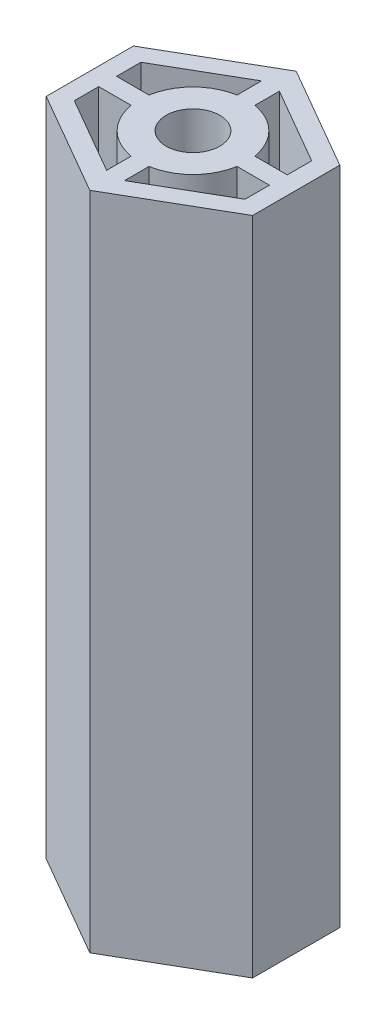
ISO-10303-21;
HEADER;
FILE_DESCRIPTION(('STEP AP214'),'2;1');
FILE_NAME('part.step','',(''),(''),'','','');
FILE_SCHEMA(('AUTOMOTIVE_DESIGN { 1 0 10303 214 1 1 1 1 }'));
ENDSEC;
DATA;
#1=APPLICATION_CONTEXT('core data for automotive mechanical design processes');
#2=APPLICATION_PROTOCOL_DEFINITION('international standard','automotive_design',2000,#1);
#3=PRODUCT_CONTEXT('',#1,'mechanical');
#4=PRODUCT('Part','Part','',(#3));
#5=PRODUCT_RELATED_PRODUCT_CATEGORY('part','',(#4));
#6=PRODUCT_DEFINITION_FORMATION('','',#4);
#7=PRODUCT_DEFINITION_CONTEXT('part definition',#1,'design');
#8=PRODUCT_DEFINITION('design','',#6,#7);
#9=PRODUCT_DEFINITION_SHAPE('','',#8);
#10=(LENGTH_UNIT() NAMED_UNIT(*) SI_UNIT(.MILLI.,.METRE.));
#11=(NAMED_UNIT(*) PLANE_ANGLE_UNIT() SI_UNIT($,.RADIAN.));
#12=(NAMED_UNIT(*) SI_UNIT($,.STERADIAN.) SOLID_ANGLE_UNIT());
#13=UNCERTAINTY_MEASURE_WITH_UNIT(LENGTH_MEASURE(1.E-05),#10,'distance_accuracy_value','');
#14=(GEOMETRIC_REPRESENTATION_CONTEXT(3) GLOBAL_UNCERTAINTY_ASSIGNED_CONTEXT((#13)) GLOBAL_UNIT_ASSIGNED_CONTEXT((#10,
#11,#12)) REPRESENTATION_CONTEXT('',''));
#15=CARTESIAN_POINT('',(0.,0.,0.));
#16=DIRECTION('',(0.,0.,1.));
#17=DIRECTION('',(1.,0.,0.));
#18=AXIS2_PLACEMENT_3D('',#15,#16,#17);
#19=CARTESIAN_POINT('',(0.,80.,0.));
#20=DIRECTION('',(0.,1.,0.));
#21=DIRECTION('',(0.,0.,1.));
#22=AXIS2_PLACEMENT_3D('',#19,#20,#21);
#23=PLANE('',#22);
#24=DIRECTION('',(0.,0.,-1.));
#25=VECTOR('',#24,1.);
#26=CARTESIAN_POINT('',(10.34,80.,1.08));
#27=LINE('',#26,#25);
#28=CARTESIAN_POINT('',(10.34,80.,4.03604505368013));
#29=VERTEX_POINT('',#28);
#30=CARTESIAN_POINT('',(10.34,80.,1.08));
#31=VERTEX_POINT('',#30);
#32=EDGE_CURVE('E222',#29,#31,#27,.T.);
#33=ORIENTED_EDGE('',*,*,#32,.F.);
#34=DIRECTION('',(0.866025403784439,0.,-0.5));
#35=VECTOR('',#34,1.);
#36=CARTESIAN_POINT('',(10.34,80.,4.03604505368013));
#37=LINE('',#36,#35);
#38=CARTESIAN_POINT('',(1.08,80.,9.38230854637606));
#39=VERTEX_POINT('',#38);
#40=EDGE_CURVE('E213',#39,#29,#37,.T.);
#41=ORIENTED_EDGE('',*,*,#40,.F.);
#42=DIRECTION('',(0.,0.,1.));
#43=VECTOR('',#42,1.);
#44=CARTESIAN_POINT('',(1.08,80.,6.40964897634808));
#45=LINE('',#44,#43);
#46=CARTESIAN_POINT('',(1.08,80.,6.40964897634808));
#47=VERTEX_POINT('',#46);
#48=EDGE_CURVE('E247',#47,#39,#45,.T.);
#49=ORIENTED_EDGE('',*,*,#48,.F.);
#50=CARTESIAN_POINT('',(0.,80.,0.));
#51=DIRECTION('',(0.,-1.,0.));
#52=DIRECTION('',(0.,0.,1.));
#53=AXIS2_PLACEMENT_3D('',#50,#51,#52);
#54=CIRCLE('',#53,6.5);
#55=CARTESIAN_POINT('',(6.40964897634808,80.,1.08));
#56=VERTEX_POINT('',#55);
#57=EDGE_CURVE('E241',#56,#47,#54,.T.);
#58=ORIENTED_EDGE('',*,*,#57,.F.);
#59=DIRECTION('',(-1.,0.,0.));
#60=VECTOR('',#59,1.);
#61=CARTESIAN_POINT('',(6.40964897634808,80.,1.08));
#62=LINE('',#61,#60);
#63=EDGE_CURVE('E237',#31,#56,#62,.T.);
#64=ORIENTED_EDGE('',*,*,#63,.F.);
#65=EDGE_LOOP('',(#33,#41,#49,#58,#64));
#66=FACE_BOUND('',#65,.T.);
#67=DIRECTION('',(-1.,0.,0.));
#68=VECTOR('',#67,1.);
#69=CARTESIAN_POINT('',(-10.34,80.,1.08));
#70=LINE('',#69,#68);
#71=CARTESIAN_POINT('',(-6.40964897634808,80.,1.08));
#72=VERTEX_POINT('',#71);
#73=CARTESIAN_POINT('',(-10.34,80.,1.08));
#74=VERTEX_POINT('',#73);
#75=EDGE_CURVE('E278',#72,#74,#70,.T.);
#76=ORIENTED_EDGE('',*,*,#75,.F.);
#77=CARTESIAN_POINT('',(0.,80.,0.));
#78=DIRECTION('',(0.,-1.,0.));
#79=DIRECTION('',(0.,0.,1.));
#80=AXIS2_PLACEMENT_3D('',#77,#78,#79);
#81=CIRCLE('',#80,6.5);
#82=CARTESIAN_POINT('',(-1.08,80.,6.40964897634808));
#83=VERTEX_POINT('',#82);
#84=EDGE_CURVE('E275',#83,#72,#81,.T.);
#85=ORIENTED_EDGE('',*,*,#84,.F.);
#86=DIRECTION('',(0.,0.,-1.));
#87=VECTOR('',#86,1.);
#88=CARTESIAN_POINT('',(-1.08,80.,6.40964897634808));
#89=LINE('',#88,#87);
#90=CARTESIAN_POINT('',(-1.08,80.,9.38230854637607));
#91=VERTEX_POINT('',#90);
#92=EDGE_CURVE('E289',#91,#83,#89,.T.);
#93=ORIENTED_EDGE('',*,*,#92,.F.);
#94=DIRECTION('',(0.866025403784439,0.,0.5));
#95=VECTOR('',#94,1.);
#96=CARTESIAN_POINT('',(-10.34,80.,4.03604505368013));
#97=LINE('',#96,#95);
#98=CARTESIAN_POINT('',(-10.34,80.,4.03604505368013));
#99=VERTEX_POINT('',#98);
#100=EDGE_CURVE('E285',#99,#91,#97,.T.);
#101=ORIENTED_EDGE('',*,*,#100,.F.);
#102=DIRECTION('',(0.,0.,1.));
#103=VECTOR('',#102,1.);
#104=CARTESIAN_POINT('',(-10.34,80.,1.08));
#105=LINE('',#104,#103);
#106=EDGE_CURVE('E282',#74,#99,#105,.T.);
#107=ORIENTED_EDGE('',*,*,#106,.F.);
#108=EDGE_LOOP('',(#76,#85,#93,#101,#107));
#109=FACE_BOUND('',#108,.T.);
#110=DIRECTION('',(0.,0.,-1.));
#111=VECTOR('',#110,1.);
#112=CARTESIAN_POINT('',(-1.08,80.,-9.38230854637594));
#113=LINE('',#112,#111);
#114=CARTESIAN_POINT('',(-1.08,80.,-6.40964897634808));
#115=VERTEX_POINT('',#114);
#116=CARTESIAN_POINT('',(-1.08,80.,-9.38230854637594));
#117=VERTEX_POINT('',#116);
#118=EDGE_CURVE('E331',#115,#117,#113,.T.);
#119=ORIENTED_EDGE('',*,*,#118,.F.);
#120=CARTESIAN_POINT('',(0.,80.,0.));
#121=DIRECTION('',(0.,-1.,0.));
#122=DIRECTION('',(0.,0.,1.));
#123=AXIS2_PLACEMENT_3D('',#120,#121,#122);
#124=CIRCLE('',#123,6.5);
#125=CARTESIAN_POINT('',(-6.40964897634808,80.,-1.08));
#126=VERTEX_POINT('',#125);
#127=EDGE_CURVE('E328',#126,#115,#124,.T.);
#128=ORIENTED_EDGE('',*,*,#127,.F.);
#129=DIRECTION('',(1.,0.,0.));
#130=VECTOR('',#129,1.);
#131=CARTESIAN_POINT('',(-10.34,80.,-1.08));
#132=LINE('',#131,#130);
#133=CARTESIAN_POINT('',(-10.34,80.,-1.08));
#134=VERTEX_POINT('',#133);
#135=EDGE_CURVE('E342',#134,#126,#132,.T.);
#136=ORIENTED_EDGE('',*,*,#135,.F.);
#137=DIRECTION('',(0.,0.,1.));
#138=VECTOR('',#137,1.);
#139=CARTESIAN_POINT('',(-10.34,80.,-4.03604505368));
#140=LINE('',#139,#138);
#141=CARTESIAN_POINT('',(-10.34,80.,-4.03604505368));
#142=VERTEX_POINT('',#141);
#143=EDGE_CURVE('E338',#142,#134,#140,.T.);
#144=ORIENTED_EDGE('',*,*,#143,.F.);
#145=DIRECTION('',(-0.866025403784439,0.,0.5));
#146=VECTOR('',#145,1.);
#147=CARTESIAN_POINT('',(-10.34,80.,-4.03604505368));
#148=LINE('',#147,#146);
#149=EDGE_CURVE('E335',#117,#142,#148,.T.);
#150=ORIENTED_EDGE('',*,*,#149,.F.);
#151=EDGE_LOOP('',(#119,#128,#136,#144,#150));
#152=FACE_BOUND('',#151,.T.);
#153=DIRECTION('',(0.,0.,1.));
#154=VECTOR('',#153,1.);
#155=CARTESIAN_POINT('',(1.08,80.,-9.38230854637594));
#156=LINE('',#155,#154);
#157=CARTESIAN_POINT('',(1.08,80.,-9.38230854637594));
#158=VERTEX_POINT('',#157);
#159=CARTESIAN_POINT('',(1.08,80.,-6.40964897634808));
#160=VERTEX_POINT('',#159);
#161=EDGE_CURVE('E384',#158,#160,#156,.T.);
#162=ORIENTED_EDGE('',*,*,#161,.F.);
#163=DIRECTION('',(-0.866025403784439,0.,-0.5));
#164=VECTOR('',#163,1.);
#165=CARTESIAN_POINT('',(10.34,80.,-4.03604505368));
#166=LINE('',#165,#164);
#167=CARTESIAN_POINT('',(10.34,80.,-4.03604505368));
#168=VERTEX_POINT('',#167);
#169=EDGE_CURVE('E381',#168,#158,#166,.T.);
#170=ORIENTED_EDGE('',*,*,#169,.F.);
#171=DIRECTION('',(0.,0.,-1.));
#172=VECTOR('',#171,1.);
#173=CARTESIAN_POINT('',(10.34,80.,-4.03604505368));
#174=LINE('',#173,#172);
#175=CARTESIAN_POINT('',(10.34,80.,-1.08));
#176=VERTEX_POINT('',#175);
#177=EDGE_CURVE('E395',#176,#168,#174,.T.);
#178=ORIENTED_EDGE('',*,*,#177,.F.);
#179=DIRECTION('',(1.,0.,0.));
#180=VECTOR('',#179,1.);
#181=CARTESIAN_POINT('',(6.40964897634808,80.,-1.08));
#182=LINE('',#181,#180);
#183=CARTESIAN_POINT('',(6.40964897634808,80.,-1.08));
#184=VERTEX_POINT('',#183);
#185=EDGE_CURVE('E391',#184,#176,#182,.T.);
#186=ORIENTED_EDGE('',*,*,#185,.F.);
#187=CARTESIAN_POINT('',(0.,80.,0.));
#188=DIRECTION('',(0.,-1.,0.));
#189=DIRECTION('',(0.,0.,1.));
#190=AXIS2_PLACEMENT_3D('',#187,#188,#189);
#191=CIRCLE('',#190,6.5);
#192=EDGE_CURVE('E388',#160,#184,#191,.T.);
#193=ORIENTED_EDGE('',*,*,#192,.F.);
#194=EDGE_LOOP('',(#162,#170,#178,#186,#193));
#195=FACE_BOUND('',#194,.T.);
#196=DIRECTION('',(-0.866025403784436,0.,0.500000000000004));
#197=VECTOR('',#196,1.);
#198=CARTESIAN_POINT('',(-12.5,80.,-5.28312163512959));
#199=LINE('',#198,#197);
#200=CARTESIAN_POINT('',(0.,80.,-12.5));
#201=VERTEX_POINT('',#200);
#202=CARTESIAN_POINT('',(-12.5,80.,-5.28312163512959));
#203=VERTEX_POINT('',#202);
#204=EDGE_CURVE('E434',#201,#203,#199,.T.);
#205=ORIENTED_EDGE('',*,*,#204,.T.);
#206=DIRECTION('',(0.,0.,1.));
#207=VECTOR('',#206,1.);
#208=CARTESIAN_POINT('',(-12.5,80.,-5.28312163512959));
#209=LINE('',#208,#207);
#210=CARTESIAN_POINT('',(-12.5,80.,5.28312163512973));
#211=VERTEX_POINT('',#210);
#212=EDGE_CURVE('E438',#203,#211,#209,.T.);
#213=ORIENTED_EDGE('',*,*,#212,.T.);
#214=DIRECTION('',(0.86602540378444,0.,0.499999999999998));
#215=VECTOR('',#214,1.);
#216=CARTESIAN_POINT('',(-12.5,80.,5.28312163512973));
#217=LINE('',#216,#215);
#218=CARTESIAN_POINT('',(0.,80.,12.5));
#219=VERTEX_POINT('',#218);
#220=EDGE_CURVE('E442',#211,#219,#217,.T.);
#221=ORIENTED_EDGE('',*,*,#220,.T.);
#222=DIRECTION('',(0.86602540378444,0.,-0.499999999999998));
#223=VECTOR('',#222,1.);
#224=CARTESIAN_POINT('',(12.5,80.,5.28312163512972));
#225=LINE('',#224,#223);
#226=CARTESIAN_POINT('',(12.5,80.,5.28312163512972));
#227=VERTEX_POINT('',#226);
#228=EDGE_CURVE('E445',#219,#227,#225,.T.);
#229=ORIENTED_EDGE('',*,*,#228,.T.);
#230=DIRECTION('',(0.,0.,-1.));
#231=VECTOR('',#230,1.);
#232=CARTESIAN_POINT('',(12.5,80.,-5.28312163512959));
#233=LINE('',#232,#231);
#234=CARTESIAN_POINT('',(12.5,80.,-5.28312163512959));
#235=VERTEX_POINT('',#234);
#236=EDGE_CURVE('E448',#227,#235,#233,.T.);
#237=ORIENTED_EDGE('',*,*,#236,.T.);
#238=DIRECTION('',(-0.866025403784436,0.,-0.500000000000004));
#239=VECTOR('',#238,1.);
#240=CARTESIAN_POINT('',(12.5,80.,-5.28312163512959));
#241=LINE('',#240,#239);
#242=EDGE_CURVE('E451',#235,#201,#241,.T.);
#243=ORIENTED_EDGE('',*,*,#242,.T.);
#244=EDGE_LOOP('',(#205,#213,#221,#229,#237,#243));
#245=FACE_BOUND('',#244,.T.);
#246=CARTESIAN_POINT('',(0.,80.,0.));
#247=DIRECTION('',(0.,1.,0.));
#248=DIRECTION('',(0.,0.,1.));
#249=AXIS2_PLACEMENT_3D('',#246,#247,#248);
#250=CIRCLE('',#249,3.25);
#251=CARTESIAN_POINT('',(0.,80.,3.25));
#252=VERTEX_POINT('',#251);
#253=EDGE_CURVE('E252',#252,#252,#250,.T.);
#254=ORIENTED_EDGE('',*,*,#253,.F.);
#255=EDGE_LOOP('',(#254));
#256=FACE_BOUND('',#255,.T.);
#257=ADVANCED_FACE('F39',(#66,#109,#152,#195,#245,#256),#23,.T.);
#258=CARTESIAN_POINT('',(0.,0.,0.));
#259=DIRECTION('',(0.,1.,0.));
#260=DIRECTION('',(0.,0.,1.));
#261=AXIS2_PLACEMENT_3D('',#258,#259,#260);
#262=PLANE('',#261);
#263=CARTESIAN_POINT('',(0.,0.,0.));
#264=DIRECTION('',(0.,-1.,0.));
#265=DIRECTION('',(0.,0.,1.));
#266=AXIS2_PLACEMENT_3D('',#263,#264,#265);
#267=CIRCLE('',#266,6.5);
#268=CARTESIAN_POINT('',(-1.08,0.,6.40964897634808));
#269=VERTEX_POINT('',#268);
#270=CARTESIAN_POINT('',(-6.40964897634808,0.,1.08));
#271=VERTEX_POINT('',#270);
#272=EDGE_CURVE('E231',#269,#271,#267,.T.);
#273=ORIENTED_EDGE('',*,*,#272,.T.);
#274=DIRECTION('',(-1.,0.,0.));
#275=VECTOR('',#274,1.);
#276=CARTESIAN_POINT('',(-10.34,0.,1.08));
#277=LINE('',#276,#275);
#278=CARTESIAN_POINT('',(-10.34,0.,1.08));
#279=VERTEX_POINT('',#278);
#280=EDGE_CURVE('E296',#271,#279,#277,.T.);
#281=ORIENTED_EDGE('',*,*,#280,.T.);
#282=DIRECTION('',(0.,0.,1.));
#283=VECTOR('',#282,1.);
#284=CARTESIAN_POINT('',(-10.34,0.,1.08));
#285=LINE('',#284,#283);
#286=CARTESIAN_POINT('',(-10.34,0.,4.03604505368013));
#287=VERTEX_POINT('',#286);
#288=EDGE_CURVE('E300',#279,#287,#285,.T.);
#289=ORIENTED_EDGE('',*,*,#288,.T.);
#290=DIRECTION('',(0.866025403784439,0.,0.5));
#291=VECTOR('',#290,1.);
#292=CARTESIAN_POINT('',(-10.34,0.,4.03604505368013));
#293=LINE('',#292,#291);
#294=CARTESIAN_POINT('',(-1.08,0.,9.38230854637607));
#295=VERTEX_POINT('',#294);
#296=EDGE_CURVE('E304',#287,#295,#293,.T.);
#297=ORIENTED_EDGE('',*,*,#296,.T.);
#298=DIRECTION('',(0.,0.,-1.));
#299=VECTOR('',#298,1.);
#300=CARTESIAN_POINT('',(-1.08,0.,6.40964897634808));
#301=LINE('',#300,#299);
#302=EDGE_CURVE('E279',#295,#269,#301,.T.);
#303=ORIENTED_EDGE('',*,*,#302,.T.);
#304=EDGE_LOOP('',(#273,#281,#289,#297,#303));
#305=FACE_BOUND('',#304,.T.);
#306=DIRECTION('',(-0.866025403784439,0.,-0.5));
#307=VECTOR('',#306,1.);
#308=CARTESIAN_POINT('',(10.34,0.,-4.03604505368));
#309=LINE('',#308,#307);
#310=CARTESIAN_POINT('',(10.34,0.,-4.03604505368));
#311=VERTEX_POINT('',#310);
#312=CARTESIAN_POINT('',(1.08,0.,-9.38230854637594));
#313=VERTEX_POINT('',#312);
#314=EDGE_CURVE('E380',#311,#313,#309,.T.);
#315=ORIENTED_EDGE('',*,*,#314,.T.);
#316=DIRECTION('',(0.,0.,1.));
#317=VECTOR('',#316,1.);
#318=CARTESIAN_POINT('',(1.08,0.,-9.38230854637594));
#319=LINE('',#318,#317);
#320=CARTESIAN_POINT('',(1.08,0.,-6.40964897634808));
#321=VERTEX_POINT('',#320);
#322=EDGE_CURVE('E402',#313,#321,#319,.T.);
#323=ORIENTED_EDGE('',*,*,#322,.T.);
#324=CARTESIAN_POINT('',(0.,0.,0.));
#325=DIRECTION('',(0.,-1.,0.));
#326=DIRECTION('',(0.,0.,1.));
#327=AXIS2_PLACEMENT_3D('',#324,#325,#326);
#328=CIRCLE('',#327,6.5);
#329=CARTESIAN_POINT('',(6.40964897634808,0.,-1.08));
#330=VERTEX_POINT('',#329);
#331=EDGE_CURVE('E406',#321,#330,#328,.T.);
#332=ORIENTED_EDGE('',*,*,#331,.T.);
#333=DIRECTION('',(1.,0.,0.));
#334=VECTOR('',#333,1.);
#335=CARTESIAN_POINT('',(6.40964897634808,0.,-1.08));
#336=LINE('',#335,#334);
#337=CARTESIAN_POINT('',(10.34,0.,-1.08));
#338=VERTEX_POINT('',#337);
#339=EDGE_CURVE('E410',#330,#338,#336,.T.);
#340=ORIENTED_EDGE('',*,*,#339,.T.);
#341=DIRECTION('',(0.,0.,-1.));
#342=VECTOR('',#341,1.);
#343=CARTESIAN_POINT('',(10.34,0.,-4.03604505368));
#344=LINE('',#343,#342);
#345=EDGE_CURVE('E385',#338,#311,#344,.T.);
#346=ORIENTED_EDGE('',*,*,#345,.T.);
#347=EDGE_LOOP('',(#315,#323,#332,#340,#346));
#348=FACE_BOUND('',#347,.T.);
#349=DIRECTION('',(-0.866025403784436,0.,0.500000000000004));
#350=VECTOR('',#349,1.);
#351=CARTESIAN_POINT('',(-12.5,0.,-5.28312163512959));
#352=LINE('',#351,#350);
#353=CARTESIAN_POINT('',(0.,0.,-12.5));
#354=VERTEX_POINT('',#353);
#355=CARTESIAN_POINT('',(-12.5,0.,-5.28312163512959));
#356=VERTEX_POINT('',#355);
#357=EDGE_CURVE('E433',#354,#356,#352,.T.);
#358=ORIENTED_EDGE('',*,*,#357,.F.);
#359=DIRECTION('',(-0.866025403784436,0.,-0.500000000000004));
#360=VECTOR('',#359,1.);
#361=CARTESIAN_POINT('',(12.5,0.,-5.28312163512959));
#362=LINE('',#361,#360);
#363=CARTESIAN_POINT('',(12.5,0.,-5.28312163512959));
#364=VERTEX_POINT('',#363);
#365=EDGE_CURVE('E439',#364,#354,#362,.T.);
#366=ORIENTED_EDGE('',*,*,#365,.F.);
#367=DIRECTION('',(0.,0.,-1.));
#368=VECTOR('',#367,1.);
#369=CARTESIAN_POINT('',(12.5,0.,-5.28312163512959));
#370=LINE('',#369,#368);
#371=CARTESIAN_POINT('',(12.5,0.,5.28312163512972));
#372=VERTEX_POINT('',#371);
#373=EDGE_CURVE('E467',#372,#364,#370,.T.);
#374=ORIENTED_EDGE('',*,*,#373,.F.);
#375=DIRECTION('',(0.86602540378444,0.,-0.499999999999998));
#376=VECTOR('',#375,1.);
#377=CARTESIAN_POINT('',(12.5,0.,5.28312163512972));
#378=LINE('',#377,#376);
#379=CARTESIAN_POINT('',(0.,0.,12.5));
#380=VERTEX_POINT('',#379);
#381=EDGE_CURVE('E464',#380,#372,#378,.T.);
#382=ORIENTED_EDGE('',*,*,#381,.F.);
#383=DIRECTION('',(0.86602540378444,0.,0.499999999999998));
#384=VECTOR('',#383,1.);
#385=CARTESIAN_POINT('',(-12.5,0.,5.28312163512973));
#386=LINE('',#385,#384);
#387=CARTESIAN_POINT('',(-12.5,0.,5.28312163512973));
#388=VERTEX_POINT('',#387);
#389=EDGE_CURVE('E461',#388,#380,#386,.T.);
#390=ORIENTED_EDGE('',*,*,#389,.F.);
#391=DIRECTION('',(0.,0.,1.));
#392=VECTOR('',#391,1.);
#393=CARTESIAN_POINT('',(-12.5,0.,-5.28312163512959));
#394=LINE('',#393,#392);
#395=EDGE_CURVE('E458',#356,#388,#394,.T.);
#396=ORIENTED_EDGE('',*,*,#395,.F.);
#397=EDGE_LOOP('',(#358,#366,#374,#382,#390,#396));
#398=FACE_BOUND('',#397,.T.);
#399=CARTESIAN_POINT('',(0.,0.,0.));
#400=DIRECTION('',(0.,-1.,0.));
#401=DIRECTION('',(0.,0.,1.));
#402=AXIS2_PLACEMENT_3D('',#399,#400,#401);
#403=CIRCLE('',#402,6.5);
#404=CARTESIAN_POINT('',(-6.40964897634808,0.,-1.08));
#405=VERTEX_POINT('',#404);
#406=CARTESIAN_POINT('',(-1.08,0.,-6.40964897634808));
#407=VERTEX_POINT('',#406);
#408=EDGE_CURVE('E327',#405,#407,#403,.T.);
#409=ORIENTED_EDGE('',*,*,#408,.T.);
#410=DIRECTION('',(0.,0.,-1.));
#411=VECTOR('',#410,1.);
#412=CARTESIAN_POINT('',(-1.08,0.,-9.38230854637594));
#413=LINE('',#412,#411);
#414=CARTESIAN_POINT('',(-1.08,0.,-9.38230854637594));
#415=VERTEX_POINT('',#414);
#416=EDGE_CURVE('E349',#407,#415,#413,.T.);
#417=ORIENTED_EDGE('',*,*,#416,.T.);
#418=DIRECTION('',(-0.866025403784439,0.,0.5));
#419=VECTOR('',#418,1.);
#420=CARTESIAN_POINT('',(-10.34,0.,-4.03604505368));
#421=LINE('',#420,#419);
#422=CARTESIAN_POINT('',(-10.34,0.,-4.03604505368));
#423=VERTEX_POINT('',#422);
#424=EDGE_CURVE('E353',#415,#423,#421,.T.);
#425=ORIENTED_EDGE('',*,*,#424,.T.);
#426=DIRECTION('',(0.,0.,1.));
#427=VECTOR('',#426,1.);
#428=CARTESIAN_POINT('',(-10.34,0.,-4.03604505368));
#429=LINE('',#428,#427);
#430=CARTESIAN_POINT('',(-10.34,0.,-1.08));
#431=VERTEX_POINT('',#430);
#432=EDGE_CURVE('E357',#423,#431,#429,.T.);
#433=ORIENTED_EDGE('',*,*,#432,.T.);
#434=DIRECTION('',(1.,0.,0.));
#435=VECTOR('',#434,1.);
#436=CARTESIAN_POINT('',(-10.34,0.,-1.08));
#437=LINE('',#436,#435);
#438=EDGE_CURVE('E332',#431,#405,#437,.T.);
#439=ORIENTED_EDGE('',*,*,#438,.T.);
#440=EDGE_LOOP('',(#409,#417,#425,#433,#439));
#441=FACE_BOUND('',#440,.T.);
#442=DIRECTION('',(0.866025403784439,0.,-0.5));
#443=VECTOR('',#442,1.);
#444=CARTESIAN_POINT('',(10.34,0.,4.03604505368013));
#445=LINE('',#444,#443);
#446=CARTESIAN_POINT('',(1.08,0.,9.38230854637606));
#447=VERTEX_POINT('',#446);
#448=CARTESIAN_POINT('',(10.34,0.,4.03604505368013));
#449=VERTEX_POINT('',#448);
#450=EDGE_CURVE('E63',#447,#449,#445,.T.);
#451=ORIENTED_EDGE('',*,*,#450,.T.);
#452=DIRECTION('',(0.,0.,-1.));
#453=VECTOR('',#452,1.);
#454=CARTESIAN_POINT('',(10.34,0.,1.08));
#455=LINE('',#454,#453);
#456=CARTESIAN_POINT('',(10.34,0.,1.08));
#457=VERTEX_POINT('',#456);
#458=EDGE_CURVE('E229',#449,#457,#455,.T.);
#459=ORIENTED_EDGE('',*,*,#458,.T.);
#460=DIRECTION('',(-1.,0.,0.));
#461=VECTOR('',#460,1.);
#462=CARTESIAN_POINT('',(6.40964897634808,0.,1.08));
#463=LINE('',#462,#461);
#464=CARTESIAN_POINT('',(6.40964897634808,0.,1.08));
#465=VERTEX_POINT('',#464);
#466=EDGE_CURVE('E255',#457,#465,#463,.T.);
#467=ORIENTED_EDGE('',*,*,#466,.T.);
#468=CARTESIAN_POINT('',(0.,0.,0.));
#469=DIRECTION('',(0.,-1.,0.));
#470=DIRECTION('',(0.,0.,1.));
#471=AXIS2_PLACEMENT_3D('',#468,#469,#470);
#472=CIRCLE('',#471,6.5);
#473=CARTESIAN_POINT('',(1.08,0.,6.40964897634808));
#474=VERTEX_POINT('',#473);
#475=EDGE_CURVE('E259',#465,#474,#472,.T.);
#476=ORIENTED_EDGE('',*,*,#475,.T.);
#477=DIRECTION('',(0.,0.,1.));
#478=VECTOR('',#477,1.);
#479=CARTESIAN_POINT('',(1.08,0.,6.40964897634808));
#480=LINE('',#479,#478);
#481=EDGE_CURVE('E223',#474,#447,#480,.T.);
#482=ORIENTED_EDGE('',*,*,#481,.T.);
#483=EDGE_LOOP('',(#451,#459,#467,#476,#482));
#484=FACE_BOUND('',#483,.T.);
#485=CARTESIAN_POINT('',(0.,0.,0.));
#486=DIRECTION('',(0.,1.,0.));
#487=DIRECTION('',(0.,0.,1.));
#488=AXIS2_PLACEMENT_3D('',#485,#486,#487);
#489=CIRCLE('',#488,3.25);
#490=CARTESIAN_POINT('',(0.,0.,3.25));
#491=VERTEX_POINT('',#490);
#492=EDGE_CURVE('E619',#491,#491,#489,.T.);
#493=ORIENTED_EDGE('',*,*,#492,.T.);
#494=EDGE_LOOP('',(#493));
#495=FACE_BOUND('',#494,.T.);
#496=ADVANCED_FACE('F498',(#305,#348,#398,#441,#484,#495),#262,.F.);
#497=CARTESIAN_POINT('',(-12.5,80.,-5.28312163512959));
#498=DIRECTION('',(0.500000000000004,0.,0.866025403784436));
#499=DIRECTION('',(0.866025403784436,0.,-0.500000000000004));
#500=AXIS2_PLACEMENT_3D('',#497,#498,#499);
#501=PLANE('',#500);
#502=ORIENTED_EDGE('',*,*,#357,.T.);
#503=DIRECTION('',(0.,-1.,0.));
#504=VECTOR('',#503,1.);
#505=CARTESIAN_POINT('',(-12.5,80.,-5.28312163512959));
#506=LINE('',#505,#504);
#507=EDGE_CURVE('E11',#203,#356,#506,.T.);
#508=ORIENTED_EDGE('',*,*,#507,.F.);
#509=ORIENTED_EDGE('',*,*,#204,.F.);
#510=DIRECTION('',(0.,-1.,0.));
#511=VECTOR('',#510,1.);
#512=CARTESIAN_POINT('',(0.,80.,-12.5));
#513=LINE('',#512,#511);
#514=EDGE_CURVE('E454',#201,#354,#513,.T.);
#515=ORIENTED_EDGE('',*,*,#514,.T.);
#516=EDGE_LOOP('',(#502,#508,#509,#515));
#517=FACE_BOUND('',#516,.T.);
#518=ADVANCED_FACE('F41',(#517),#501,.F.);
#519=CARTESIAN_POINT('',(-12.5,80.,-5.28312163512959));
#520=DIRECTION('',(1.,0.,0.));
#521=DIRECTION('',(0.,0.,-1.));
#522=AXIS2_PLACEMENT_3D('',#519,#520,#521);
#523=PLANE('',#522);
#524=ORIENTED_EDGE('',*,*,#395,.T.);
#525=DIRECTION('',(0.,-1.,0.));
#526=VECTOR('',#525,1.);
#527=CARTESIAN_POINT('',(-12.5,80.,5.28312163512973));
#528=LINE('',#527,#526);
#529=EDGE_CURVE('E48',#211,#388,#528,.T.);
#530=ORIENTED_EDGE('',*,*,#529,.F.);
#531=ORIENTED_EDGE('',*,*,#212,.F.);
#532=ORIENTED_EDGE('',*,*,#507,.T.);
#533=EDGE_LOOP('',(#524,#530,#531,#532));
#534=FACE_BOUND('',#533,.T.);
#535=ADVANCED_FACE('F516',(#534),#523,.F.);
#536=CARTESIAN_POINT('',(-12.5,80.,5.28312163512973));
#537=DIRECTION('',(0.499999999999998,0.,-0.86602540378444));
#538=DIRECTION('',(-0.86602540378444,0.,-0.499999999999998));
#539=AXIS2_PLACEMENT_3D('',#536,#537,#538);
#540=PLANE('',#539);
#541=ORIENTED_EDGE('',*,*,#389,.T.);
#542=DIRECTION('',(0.,-1.,0.));
#543=VECTOR('',#542,1.);
#544=CARTESIAN_POINT('',(0.,80.,12.5));
#545=LINE('',#544,#543);
#546=EDGE_CURVE('E483',#219,#380,#545,.T.);
#547=ORIENTED_EDGE('',*,*,#546,.F.);
#548=ORIENTED_EDGE('',*,*,#220,.F.);
#549=ORIENTED_EDGE('',*,*,#529,.T.);
#550=EDGE_LOOP('',(#541,#547,#548,#549));
#551=FACE_BOUND('',#550,.T.);
#552=ADVANCED_FACE('F492',(#551),#540,.F.);
#553=CARTESIAN_POINT('',(12.5,80.,5.28312163512972));
#554=DIRECTION('',(-0.499999999999998,0.,-0.86602540378444));
#555=DIRECTION('',(-0.86602540378444,0.,0.499999999999998));
#556=AXIS2_PLACEMENT_3D('',#553,#554,#555);
#557=PLANE('',#556);
#558=ORIENTED_EDGE('',*,*,#381,.T.);
#559=DIRECTION('',(0.,-1.,0.));
#560=VECTOR('',#559,1.);
#561=CARTESIAN_POINT('',(12.5,80.,5.28312163512972));
#562=LINE('',#561,#560);
#563=EDGE_CURVE('E479',#227,#372,#562,.T.);
#564=ORIENTED_EDGE('',*,*,#563,.F.);
#565=ORIENTED_EDGE('',*,*,#228,.F.);
#566=ORIENTED_EDGE('',*,*,#546,.T.);
#567=EDGE_LOOP('',(#558,#564,#565,#566));
#568=FACE_BOUND('',#567,.T.);
#569=ADVANCED_FACE('F504',(#568),#557,.F.);
#570=CARTESIAN_POINT('',(12.5,80.,-5.28312163512959));
#571=DIRECTION('',(-1.,0.,0.));
#572=DIRECTION('',(0.,0.,1.));
#573=AXIS2_PLACEMENT_3D('',#570,#571,#572);
#574=PLANE('',#573);
#575=ORIENTED_EDGE('',*,*,#373,.T.);
#576=DIRECTION('',(0.,-1.,0.));
#577=VECTOR('',#576,1.);
#578=CARTESIAN_POINT('',(12.5,80.,-5.28312163512959));
#579=LINE('',#578,#577);
#580=EDGE_CURVE('E475',#235,#364,#579,.T.);
#581=ORIENTED_EDGE('',*,*,#580,.F.);
#582=ORIENTED_EDGE('',*,*,#236,.F.);
#583=ORIENTED_EDGE('',*,*,#563,.T.);
#584=EDGE_LOOP('',(#575,#581,#582,#583));
#585=FACE_BOUND('',#584,.T.);
#586=ADVANCED_FACE('F508',(#585),#574,.F.);
#587=CARTESIAN_POINT('',(12.5,80.,-5.28312163512959));
#588=DIRECTION('',(-0.500000000000004,0.,0.866025403784436));
#589=DIRECTION('',(0.866025403784436,0.,0.500000000000004));
#590=AXIS2_PLACEMENT_3D('',#587,#588,#589);
#591=PLANE('',#590);
#592=ORIENTED_EDGE('',*,*,#365,.T.);
#593=ORIENTED_EDGE('',*,*,#514,.F.);
#594=ORIENTED_EDGE('',*,*,#242,.F.);
#595=ORIENTED_EDGE('',*,*,#580,.T.);
#596=EDGE_LOOP('',(#592,#593,#594,#595));
#597=FACE_BOUND('',#596,.T.);
#598=ADVANCED_FACE('F519',(#597),#591,.F.);
#599=CARTESIAN_POINT('',(10.34,80.,-4.03604505368));
#600=DIRECTION('',(-0.5,0.,0.866025403784439));
#601=DIRECTION('',(0.866025403784439,0.,0.5));
#602=AXIS2_PLACEMENT_3D('',#599,#600,#601);
#603=PLANE('',#602);
#604=ORIENTED_EDGE('',*,*,#314,.F.);
#605=DIRECTION('',(0.,-1.,0.));
#606=VECTOR('',#605,1.);
#607=CARTESIAN_POINT('',(10.34,80.,-4.03604505368));
#608=LINE('',#607,#606);
#609=EDGE_CURVE('E398',#168,#311,#608,.T.);
#610=ORIENTED_EDGE('',*,*,#609,.F.);
#611=ORIENTED_EDGE('',*,*,#169,.T.);
#612=DIRECTION('',(0.,-1.,0.));
#613=VECTOR('',#612,1.);
#614=CARTESIAN_POINT('',(1.08,80.,-9.38230854637594));
#615=LINE('',#614,#613);
#616=EDGE_CURVE('E429',#158,#313,#615,.T.);
#617=ORIENTED_EDGE('',*,*,#616,.T.);
#618=EDGE_LOOP('',(#604,#610,#611,#617));
#619=FACE_BOUND('',#618,.T.);
#620=ADVANCED_FACE('F521',(#619),#603,.T.);
#621=CARTESIAN_POINT('',(1.08,80.,-9.38230854637594));
#622=DIRECTION('',(1.,0.,0.));
#623=DIRECTION('',(0.,0.,-1.));
#624=AXIS2_PLACEMENT_3D('',#621,#622,#623);
#625=PLANE('',#624);
#626=ORIENTED_EDGE('',*,*,#322,.F.);
#627=ORIENTED_EDGE('',*,*,#616,.F.);
#628=ORIENTED_EDGE('',*,*,#161,.T.);
#629=DIRECTION('',(0.,-1.,0.));
#630=VECTOR('',#629,1.);
#631=CARTESIAN_POINT('',(1.08,80.,-6.40964897634808));
#632=LINE('',#631,#630);
#633=EDGE_CURVE('E426',#160,#321,#632,.T.);
#634=ORIENTED_EDGE('',*,*,#633,.T.);
#635=EDGE_LOOP('',(#626,#627,#628,#634));
#636=FACE_BOUND('',#635,.T.);
#637=ADVANCED_FACE('F527',(#636),#625,.T.);
#638=CARTESIAN_POINT('',(0.,80.,0.));
#639=DIRECTION('',(0.,-1.,0.));
#640=DIRECTION('',(0.,0.,-1.));
#641=AXIS2_PLACEMENT_3D('',#638,#639,#640);
#642=CYLINDRICAL_SURFACE('',#641,6.5);
#643=ORIENTED_EDGE('',*,*,#331,.F.);
#644=ORIENTED_EDGE('',*,*,#633,.F.);
#645=ORIENTED_EDGE('',*,*,#192,.T.);
#646=DIRECTION('',(0.,-1.,0.));
#647=VECTOR('',#646,1.);
#648=CARTESIAN_POINT('',(6.40964897634808,80.,-1.08));
#649=LINE('',#648,#647);
#650=EDGE_CURVE('E423',#184,#330,#649,.T.);
#651=ORIENTED_EDGE('',*,*,#650,.T.);
#652=EDGE_LOOP('',(#643,#644,#645,#651));
#653=FACE_BOUND('',#652,.T.);
#654=ADVANCED_FACE('F541',(#653),#642,.T.);
#655=CARTESIAN_POINT('',(6.40964897634808,80.,-1.08));
#656=DIRECTION('',(0.,0.,-1.));
#657=DIRECTION('',(-1.,0.,0.));
#658=AXIS2_PLACEMENT_3D('',#655,#656,#657);
#659=PLANE('',#658);
#660=ORIENTED_EDGE('',*,*,#339,.F.);
#661=ORIENTED_EDGE('',*,*,#650,.F.);
#662=ORIENTED_EDGE('',*,*,#185,.T.);
#663=DIRECTION('',(0.,-1.,0.));
#664=VECTOR('',#663,1.);
#665=CARTESIAN_POINT('',(10.34,80.,-1.08));
#666=LINE('',#665,#664);
#667=EDGE_CURVE('E420',#176,#338,#666,.T.);
#668=ORIENTED_EDGE('',*,*,#667,.T.);
#669=EDGE_LOOP('',(#660,#661,#662,#668));
#670=FACE_BOUND('',#669,.T.);
#671=ADVANCED_FACE('F545',(#670),#659,.T.);
#672=CARTESIAN_POINT('',(10.34,80.,-4.03604505368));
#673=DIRECTION('',(-1.,0.,0.));
#674=DIRECTION('',(0.,0.,1.));
#675=AXIS2_PLACEMENT_3D('',#672,#673,#674);
#676=PLANE('',#675);
#677=ORIENTED_EDGE('',*,*,#345,.F.);
#678=ORIENTED_EDGE('',*,*,#667,.F.);
#679=ORIENTED_EDGE('',*,*,#177,.T.);
#680=ORIENTED_EDGE('',*,*,#609,.T.);
#681=EDGE_LOOP('',(#677,#678,#679,#680));
#682=FACE_BOUND('',#681,.T.);
#683=ADVANCED_FACE('F549',(#682),#676,.T.);
#684=CARTESIAN_POINT('',(0.,80.,0.));
#685=DIRECTION('',(0.,-1.,0.));
#686=DIRECTION('',(0.,0.,-1.));
#687=AXIS2_PLACEMENT_3D('',#684,#685,#686);
#688=CYLINDRICAL_SURFACE('',#687,6.5);
#689=ORIENTED_EDGE('',*,*,#408,.F.);
#690=DIRECTION('',(0.,-1.,0.));
#691=VECTOR('',#690,1.);
#692=CARTESIAN_POINT('',(-6.40964897634808,80.,-1.08));
#693=LINE('',#692,#691);
#694=EDGE_CURVE('E345',#126,#405,#693,.T.);
#695=ORIENTED_EDGE('',*,*,#694,.F.);
#696=ORIENTED_EDGE('',*,*,#127,.T.);
#697=DIRECTION('',(0.,-1.,0.));
#698=VECTOR('',#697,1.);
#699=CARTESIAN_POINT('',(-1.08,80.,-6.40964897634808));
#700=LINE('',#699,#698);
#701=EDGE_CURVE('E376',#115,#407,#700,.T.);
#702=ORIENTED_EDGE('',*,*,#701,.T.);
#703=EDGE_LOOP('',(#689,#695,#696,#702));
#704=FACE_BOUND('',#703,.T.);
#705=ADVANCED_FACE('F553',(#704),#688,.T.);
#706=CARTESIAN_POINT('',(-1.08,80.,-9.38230854637594));
#707=DIRECTION('',(-1.,0.,0.));
#708=DIRECTION('',(0.,0.,1.));
#709=AXIS2_PLACEMENT_3D('',#706,#707,#708);
#710=PLANE('',#709);
#711=ORIENTED_EDGE('',*,*,#416,.F.);
#712=ORIENTED_EDGE('',*,*,#701,.F.);
#713=ORIENTED_EDGE('',*,*,#118,.T.);
#714=DIRECTION('',(0.,-1.,0.));
#715=VECTOR('',#714,1.);
#716=CARTESIAN_POINT('',(-1.08,80.,-9.38230854637594));
#717=LINE('',#716,#715);
#718=EDGE_CURVE('E373',#117,#415,#717,.T.);
#719=ORIENTED_EDGE('',*,*,#718,.T.);
#720=EDGE_LOOP('',(#711,#712,#713,#719));
#721=FACE_BOUND('',#720,.T.);
#722=ADVANCED_FACE('F557',(#721),#710,.T.);
#723=CARTESIAN_POINT('',(-10.34,80.,-4.03604505368));
#724=DIRECTION('',(0.5,0.,0.866025403784439));
#725=DIRECTION('',(0.866025403784439,0.,-0.5));
#726=AXIS2_PLACEMENT_3D('',#723,#724,#725);
#727=PLANE('',#726);
#728=ORIENTED_EDGE('',*,*,#424,.F.);
#729=ORIENTED_EDGE('',*,*,#718,.F.);
#730=ORIENTED_EDGE('',*,*,#149,.T.);
#731=DIRECTION('',(0.,-1.,0.));
#732=VECTOR('',#731,1.);
#733=CARTESIAN_POINT('',(-10.34,80.,-4.03604505368));
#734=LINE('',#733,#732);
#735=EDGE_CURVE('E370',#142,#423,#734,.T.);
#736=ORIENTED_EDGE('',*,*,#735,.T.);
#737=EDGE_LOOP('',(#728,#729,#730,#736));
#738=FACE_BOUND('',#737,.T.);
#739=ADVANCED_FACE('F561',(#738),#727,.T.);
#740=CARTESIAN_POINT('',(-10.34,80.,-4.03604505368));
#741=DIRECTION('',(1.,0.,0.));
#742=DIRECTION('',(0.,0.,-1.));
#743=AXIS2_PLACEMENT_3D('',#740,#741,#742);
#744=PLANE('',#743);
#745=ORIENTED_EDGE('',*,*,#432,.F.);
#746=ORIENTED_EDGE('',*,*,#735,.F.);
#747=ORIENTED_EDGE('',*,*,#143,.T.);
#748=DIRECTION('',(0.,-1.,0.));
#749=VECTOR('',#748,1.);
#750=CARTESIAN_POINT('',(-10.34,80.,-1.08));
#751=LINE('',#750,#749);
#752=EDGE_CURVE('E367',#134,#431,#751,.T.);
#753=ORIENTED_EDGE('',*,*,#752,.T.);
#754=EDGE_LOOP('',(#745,#746,#747,#753));
#755=FACE_BOUND('',#754,.T.);
#756=ADVANCED_FACE('F565',(#755),#744,.T.);
#757=CARTESIAN_POINT('',(-10.34,80.,-1.08));
#758=DIRECTION('',(0.,0.,-1.));
#759=DIRECTION('',(-1.,0.,0.));
#760=AXIS2_PLACEMENT_3D('',#757,#758,#759);
#761=PLANE('',#760);
#762=ORIENTED_EDGE('',*,*,#438,.F.);
#763=ORIENTED_EDGE('',*,*,#752,.F.);
#764=ORIENTED_EDGE('',*,*,#135,.T.);
#765=ORIENTED_EDGE('',*,*,#694,.T.);
#766=EDGE_LOOP('',(#762,#763,#764,#765));
#767=FACE_BOUND('',#766,.T.);
#768=ADVANCED_FACE('F569',(#767),#761,.T.);
#769=CARTESIAN_POINT('',(0.,80.,0.));
#770=DIRECTION('',(0.,-1.,0.));
#771=DIRECTION('',(0.,0.,-1.));
#772=AXIS2_PLACEMENT_3D('',#769,#770,#771);
#773=CYLINDRICAL_SURFACE('',#772,6.5);
#774=ORIENTED_EDGE('',*,*,#272,.F.);
#775=DIRECTION('',(0.,-1.,0.));
#776=VECTOR('',#775,1.);
#777=CARTESIAN_POINT('',(-1.08,80.,6.40964897634808));
#778=LINE('',#777,#776);
#779=EDGE_CURVE('E292',#83,#269,#778,.T.);
#780=ORIENTED_EDGE('',*,*,#779,.F.);
#781=ORIENTED_EDGE('',*,*,#84,.T.);
#782=DIRECTION('',(0.,-1.,0.));
#783=VECTOR('',#782,1.);
#784=CARTESIAN_POINT('',(-6.40964897634808,80.,1.08));
#785=LINE('',#784,#783);
#786=EDGE_CURVE('E323',#72,#271,#785,.T.);
#787=ORIENTED_EDGE('',*,*,#786,.T.);
#788=EDGE_LOOP('',(#774,#780,#781,#787));
#789=FACE_BOUND('',#788,.T.);
#790=ADVANCED_FACE('F573',(#789),#773,.T.);
#791=CARTESIAN_POINT('',(-10.34,80.,1.08));
#792=DIRECTION('',(0.,0.,1.));
#793=DIRECTION('',(1.,0.,0.));
#794=AXIS2_PLACEMENT_3D('',#791,#792,#793);
#795=PLANE('',#794);
#796=ORIENTED_EDGE('',*,*,#280,.F.);
#797=ORIENTED_EDGE('',*,*,#786,.F.);
#798=ORIENTED_EDGE('',*,*,#75,.T.);
#799=DIRECTION('',(0.,-1.,0.));
#800=VECTOR('',#799,1.);
#801=CARTESIAN_POINT('',(-10.34,80.,1.08));
#802=LINE('',#801,#800);
#803=EDGE_CURVE('E320',#74,#279,#802,.T.);
#804=ORIENTED_EDGE('',*,*,#803,.T.);
#805=EDGE_LOOP('',(#796,#797,#798,#804));
#806=FACE_BOUND('',#805,.T.);
#807=ADVANCED_FACE('F577',(#806),#795,.T.);
#808=CARTESIAN_POINT('',(-10.34,80.,1.08));
#809=DIRECTION('',(1.,0.,0.));
#810=DIRECTION('',(0.,0.,-1.));
#811=AXIS2_PLACEMENT_3D('',#808,#809,#810);
#812=PLANE('',#811);
#813=ORIENTED_EDGE('',*,*,#288,.F.);
#814=ORIENTED_EDGE('',*,*,#803,.F.);
#815=ORIENTED_EDGE('',*,*,#106,.T.);
#816=DIRECTION('',(0.,-1.,0.));
#817=VECTOR('',#816,1.);
#818=CARTESIAN_POINT('',(-10.34,80.,4.03604505368013));
#819=LINE('',#818,#817);
#820=EDGE_CURVE('E317',#99,#287,#819,.T.);
#821=ORIENTED_EDGE('',*,*,#820,.T.);
#822=EDGE_LOOP('',(#813,#814,#815,#821));
#823=FACE_BOUND('',#822,.T.);
#824=ADVANCED_FACE('F581',(#823),#812,.T.);
#825=CARTESIAN_POINT('',(-10.34,80.,4.03604505368013));
#826=DIRECTION('',(0.5,0.,-0.866025403784439));
#827=DIRECTION('',(-0.866025403784439,0.,-0.5));
#828=AXIS2_PLACEMENT_3D('',#825,#826,#827);
#829=PLANE('',#828);
#830=ORIENTED_EDGE('',*,*,#296,.F.);
#831=ORIENTED_EDGE('',*,*,#820,.F.);
#832=ORIENTED_EDGE('',*,*,#100,.T.);
#833=DIRECTION('',(0.,-1.,0.));
#834=VECTOR('',#833,1.);
#835=CARTESIAN_POINT('',(-1.08,80.,9.38230854637607));
#836=LINE('',#835,#834);
#837=EDGE_CURVE('E314',#91,#295,#836,.T.);
#838=ORIENTED_EDGE('',*,*,#837,.T.);
#839=EDGE_LOOP('',(#830,#831,#832,#838));
#840=FACE_BOUND('',#839,.T.);
#841=ADVANCED_FACE('F585',(#840),#829,.T.);
#842=CARTESIAN_POINT('',(-1.08,80.,6.40964897634808));
#843=DIRECTION('',(-1.,0.,0.));
#844=DIRECTION('',(0.,0.,1.));
#845=AXIS2_PLACEMENT_3D('',#842,#843,#844);
#846=PLANE('',#845);
#847=ORIENTED_EDGE('',*,*,#302,.F.);
#848=ORIENTED_EDGE('',*,*,#837,.F.);
#849=ORIENTED_EDGE('',*,*,#92,.T.);
#850=ORIENTED_EDGE('',*,*,#779,.T.);
#851=EDGE_LOOP('',(#847,#848,#849,#850));
#852=FACE_BOUND('',#851,.T.);
#853=ADVANCED_FACE('F589',(#852),#846,.T.);
#854=CARTESIAN_POINT('',(10.34,80.,4.03604505368013));
#855=DIRECTION('',(-0.5,0.,-0.866025403784439));
#856=DIRECTION('',(-0.866025403784439,0.,0.5));
#857=AXIS2_PLACEMENT_3D('',#854,#855,#856);
#858=PLANE('',#857);
#859=ORIENTED_EDGE('',*,*,#450,.F.);
#860=DIRECTION('',(0.,-1.,0.));
#861=VECTOR('',#860,1.);
#862=CARTESIAN_POINT('',(1.08,80.,9.38230854637606));
#863=LINE('',#862,#861);
#864=EDGE_CURVE('E217',#39,#447,#863,.T.);
#865=ORIENTED_EDGE('',*,*,#864,.F.);
#866=ORIENTED_EDGE('',*,*,#40,.T.);
#867=DIRECTION('',(0.,-1.,0.));
#868=VECTOR('',#867,1.);
#869=CARTESIAN_POINT('',(10.34,80.,4.03604505368013));
#870=LINE('',#869,#868);
#871=EDGE_CURVE('E216',#29,#449,#870,.T.);
#872=ORIENTED_EDGE('',*,*,#871,.T.);
#873=EDGE_LOOP('',(#859,#865,#866,#872));
#874=FACE_BOUND('',#873,.T.);
#875=ADVANCED_FACE('F215',(#874),#858,.T.);
#876=CARTESIAN_POINT('',(10.34,80.,1.08));
#877=DIRECTION('',(-1.,0.,0.));
#878=DIRECTION('',(0.,0.,1.));
#879=AXIS2_PLACEMENT_3D('',#876,#877,#878);
#880=PLANE('',#879);
#881=ORIENTED_EDGE('',*,*,#458,.F.);
#882=ORIENTED_EDGE('',*,*,#871,.F.);
#883=ORIENTED_EDGE('',*,*,#32,.T.);
#884=DIRECTION('',(0.,-1.,0.));
#885=VECTOR('',#884,1.);
#886=CARTESIAN_POINT('',(10.34,80.,1.08));
#887=LINE('',#886,#885);
#888=EDGE_CURVE('E232',#31,#457,#887,.T.);
#889=ORIENTED_EDGE('',*,*,#888,.T.);
#890=EDGE_LOOP('',(#881,#882,#883,#889));
#891=FACE_BOUND('',#890,.T.);
#892=ADVANCED_FACE('F226',(#891),#880,.T.);
#893=CARTESIAN_POINT('',(6.40964897634808,80.,1.08));
#894=DIRECTION('',(0.,0.,1.));
#895=DIRECTION('',(1.,0.,0.));
#896=AXIS2_PLACEMENT_3D('',#893,#894,#895);
#897=PLANE('',#896);
#898=ORIENTED_EDGE('',*,*,#466,.F.);
#899=ORIENTED_EDGE('',*,*,#888,.F.);
#900=ORIENTED_EDGE('',*,*,#63,.T.);
#901=DIRECTION('',(0.,-1.,0.));
#902=VECTOR('',#901,1.);
#903=CARTESIAN_POINT('',(6.40964897634808,80.,1.08));
#904=LINE('',#903,#902);
#905=EDGE_CURVE('E270',#56,#465,#904,.T.);
#906=ORIENTED_EDGE('',*,*,#905,.T.);
#907=EDGE_LOOP('',(#898,#899,#900,#906));
#908=FACE_BOUND('',#907,.T.);
#909=ADVANCED_FACE('F598',(#908),#897,.T.);
#910=CARTESIAN_POINT('',(0.,80.,0.));
#911=DIRECTION('',(0.,-1.,0.));
#912=DIRECTION('',(0.,0.,-1.));
#913=AXIS2_PLACEMENT_3D('',#910,#911,#912);
#914=CYLINDRICAL_SURFACE('',#913,6.5);
#915=ORIENTED_EDGE('',*,*,#475,.F.);
#916=ORIENTED_EDGE('',*,*,#905,.F.);
#917=ORIENTED_EDGE('',*,*,#57,.T.);
#918=DIRECTION('',(0.,-1.,0.));
#919=VECTOR('',#918,1.);
#920=CARTESIAN_POINT('',(1.08,80.,6.40964897634808));
#921=LINE('',#920,#919);
#922=EDGE_CURVE('E55',#47,#474,#921,.T.);
#923=ORIENTED_EDGE('',*,*,#922,.T.);
#924=EDGE_LOOP('',(#915,#916,#917,#923));
#925=FACE_BOUND('',#924,.T.);
#926=ADVANCED_FACE('F601',(#925),#914,.T.);
#927=CARTESIAN_POINT('',(1.08,80.,6.40964897634808));
#928=DIRECTION('',(1.,0.,0.));
#929=DIRECTION('',(0.,0.,-1.));
#930=AXIS2_PLACEMENT_3D('',#927,#928,#929);
#931=PLANE('',#930);
#932=ORIENTED_EDGE('',*,*,#481,.F.);
#933=ORIENTED_EDGE('',*,*,#922,.F.);
#934=ORIENTED_EDGE('',*,*,#48,.T.);
#935=ORIENTED_EDGE('',*,*,#864,.T.);
#936=EDGE_LOOP('',(#932,#933,#934,#935));
#937=FACE_BOUND('',#936,.T.);
#938=ADVANCED_FACE('F605',(#937),#931,.T.);
#939=CARTESIAN_POINT('',(0.,80.,0.));
#940=DIRECTION('',(0.,-1.,0.));
#941=DIRECTION('',(0.,0.,-1.));
#942=AXIS2_PLACEMENT_3D('',#939,#940,#941);
#943=CYLINDRICAL_SURFACE('',#942,3.25);
#944=ORIENTED_EDGE('',*,*,#253,.T.);
#945=EDGE_LOOP('',(#944));
#946=FACE_BOUND('',#945,.T.);
#947=ORIENTED_EDGE('',*,*,#492,.F.);
#948=EDGE_LOOP('',(#947));
#949=FACE_BOUND('',#948,.T.);
#950=ADVANCED_FACE('F609',(#946,#949),#943,.F.);
#951=CLOSED_SHELL('',(#257,#496,#518,#535,#552,#569,#586,#598,#620,#637,#654,#671,#683,#705,
#722,#739,#756,#768,#790,#807,#824,#841,#853,#875,#892,#909,#926,#938,#950));
#952=MANIFOLD_SOLID_BREP('B2',#951);
#953=ADVANCED_BREP_SHAPE_REPRESENTATION('',(#18,#952),#14);
#954=SHAPE_DEFINITION_REPRESENTATION(#9,#953);
ENDSEC;
END-ISO-10303-21;
